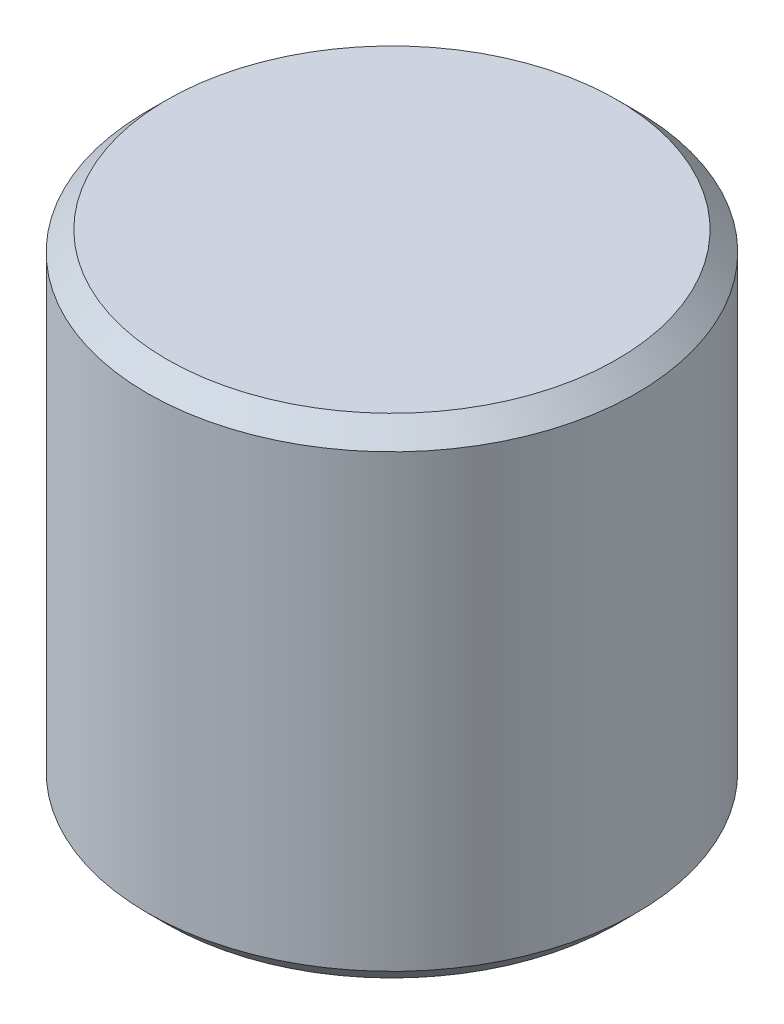
ISO-10303-21;
HEADER;
FILE_DESCRIPTION(('STEP AP214'),'2;1');
FILE_NAME('part.step','',(''),(''),'','','');
FILE_SCHEMA(('AUTOMOTIVE_DESIGN { 1 0 10303 214 1 1 1 1 }'));
ENDSEC;
DATA;
#1=APPLICATION_CONTEXT('core data for automotive mechanical design processes');
#2=APPLICATION_PROTOCOL_DEFINITION('international standard','automotive_design',2000,#1);
#3=PRODUCT_CONTEXT('',#1,'mechanical');
#4=PRODUCT('Part','Part','',(#3));
#5=PRODUCT_RELATED_PRODUCT_CATEGORY('part','',(#4));
#6=PRODUCT_DEFINITION_FORMATION('','',#4);
#7=PRODUCT_DEFINITION_CONTEXT('part definition',#1,'design');
#8=PRODUCT_DEFINITION('design','',#6,#7);
#9=PRODUCT_DEFINITION_SHAPE('','',#8);
#10=(LENGTH_UNIT() NAMED_UNIT(*) SI_UNIT(.MILLI.,.METRE.));
#11=(NAMED_UNIT(*) PLANE_ANGLE_UNIT() SI_UNIT($,.RADIAN.));
#12=(NAMED_UNIT(*) SI_UNIT($,.STERADIAN.) SOLID_ANGLE_UNIT());
#13=UNCERTAINTY_MEASURE_WITH_UNIT(LENGTH_MEASURE(1.E-05),#10,'distance_accuracy_value','');
#14=(GEOMETRIC_REPRESENTATION_CONTEXT(3) GLOBAL_UNCERTAINTY_ASSIGNED_CONTEXT((#13)) GLOBAL_UNIT_ASSIGNED_CONTEXT((#10,
#11,#12)) REPRESENTATION_CONTEXT('',''));
#15=CARTESIAN_POINT('',(0.,0.,0.));
#16=DIRECTION('',(0.,0.,1.));
#17=DIRECTION('',(1.,0.,0.));
#18=AXIS2_PLACEMENT_3D('',#15,#16,#17);
#19=CARTESIAN_POINT('',(0.,10.,0.));
#20=DIRECTION('',(0.,-1.,0.));
#21=DIRECTION('',(0.,0.,-1.));
#22=AXIS2_PLACEMENT_3D('',#19,#20,#21);
#23=CYLINDRICAL_SURFACE('',#22,5.);
#24=CARTESIAN_POINT('',(0.,0.399999999999999,0.));
#25=DIRECTION('',(0.,1.,0.));
#26=DIRECTION('',(0.,0.,1.));
#27=AXIS2_PLACEMENT_3D('',#24,#25,#26);
#28=CIRCLE('',#27,5.);
#29=CARTESIAN_POINT('',(0.,0.399999999999999,5.));
#30=VERTEX_POINT('',#29);
#31=EDGE_CURVE('E51',#30,#30,#28,.T.);
#32=ORIENTED_EDGE('',*,*,#31,.T.);
#33=EDGE_LOOP('',(#32));
#34=FACE_BOUND('',#33,.T.);
#35=CARTESIAN_POINT('',(0.,9.6,0.));
#36=DIRECTION('',(0.,1.,0.));
#37=DIRECTION('',(0.,0.,1.));
#38=AXIS2_PLACEMENT_3D('',#35,#36,#37);
#39=CIRCLE('',#38,5.);
#40=CARTESIAN_POINT('',(0.,9.6,5.));
#41=VERTEX_POINT('',#40);
#42=EDGE_CURVE('E55',#41,#41,#39,.F.);
#43=ORIENTED_EDGE('',*,*,#42,.T.);
#44=EDGE_LOOP('',(#43));
#45=FACE_BOUND('',#44,.T.);
#46=ADVANCED_FACE('F39',(#34,#45),#23,.T.);
#47=CARTESIAN_POINT('',(0.,10.,0.));
#48=DIRECTION('',(0.,1.,0.));
#49=DIRECTION('',(0.,0.,1.));
#50=AXIS2_PLACEMENT_3D('',#47,#48,#49);
#51=PLANE('',#50);
#52=CARTESIAN_POINT('',(0.,10.,0.));
#53=DIRECTION('',(0.,1.,0.));
#54=DIRECTION('',(0.,0.,1.));
#55=AXIS2_PLACEMENT_3D('',#52,#53,#54);
#56=CIRCLE('',#55,4.6);
#57=CARTESIAN_POINT('',(0.,10.,4.6));
#58=VERTEX_POINT('',#57);
#59=EDGE_CURVE('E10',#58,#58,#56,.T.);
#60=ORIENTED_EDGE('',*,*,#59,.T.);
#61=EDGE_LOOP('',(#60));
#62=FACE_BOUND('',#61,.T.);
#63=ADVANCED_FACE('F71',(#62),#51,.T.);
#64=CARTESIAN_POINT('',(0.,0.,0.));
#65=DIRECTION('',(0.,1.,0.));
#66=DIRECTION('',(0.,0.,1.));
#67=AXIS2_PLACEMENT_3D('',#64,#65,#66);
#68=PLANE('',#67);
#69=CARTESIAN_POINT('',(0.,0.,0.));
#70=DIRECTION('',(0.,1.,0.));
#71=DIRECTION('',(0.,0.,1.));
#72=AXIS2_PLACEMENT_3D('',#69,#70,#71);
#73=CIRCLE('',#72,4.6);
#74=CARTESIAN_POINT('',(0.,0.,4.6));
#75=VERTEX_POINT('',#74);
#76=EDGE_CURVE('E47',#75,#75,#73,.F.);
#77=ORIENTED_EDGE('',*,*,#76,.T.);
#78=EDGE_LOOP('',(#77));
#79=FACE_BOUND('',#78,.T.);
#80=ADVANCED_FACE('F68',(#79),#68,.F.);
#81=CARTESIAN_POINT('',(0.,0.399999999999999,0.));
#82=DIRECTION('',(0.,1.,0.));
#83=DIRECTION('',(0.,0.,1.));
#84=AXIS2_PLACEMENT_3D('',#81,#82,#83);
#85=CONICAL_SURFACE('',#84,5.,0.785398163397449);
#86=ORIENTED_EDGE('',*,*,#76,.F.);
#87=EDGE_LOOP('',(#86));
#88=FACE_BOUND('',#87,.T.);
#89=ORIENTED_EDGE('',*,*,#31,.F.);
#90=EDGE_LOOP('',(#89));
#91=FACE_BOUND('',#90,.T.);
#92=ADVANCED_FACE('F64',(#88,#91),#85,.T.);
#93=CARTESIAN_POINT('',(0.,10.,0.));
#94=DIRECTION('',(0.,-1.,0.));
#95=DIRECTION('',(0.,0.,-1.));
#96=AXIS2_PLACEMENT_3D('',#93,#94,#95);
#97=CONICAL_SURFACE('',#96,4.6,0.785398163397443);
#98=ORIENTED_EDGE('',*,*,#42,.F.);
#99=EDGE_LOOP('',(#98));
#100=FACE_BOUND('',#99,.T.);
#101=ORIENTED_EDGE('',*,*,#59,.F.);
#102=EDGE_LOOP('',(#101));
#103=FACE_BOUND('',#102,.T.);
#104=ADVANCED_FACE('F42',(#100,#103),#97,.T.);
#105=CLOSED_SHELL('',(#46,#63,#80,#92,#104));
#106=MANIFOLD_SOLID_BREP('B2',#105);
#107=ADVANCED_BREP_SHAPE_REPRESENTATION('',(#18,#106),#14);
#108=SHAPE_DEFINITION_REPRESENTATION(#9,#107);
ENDSEC;
END-ISO-10303-21;
